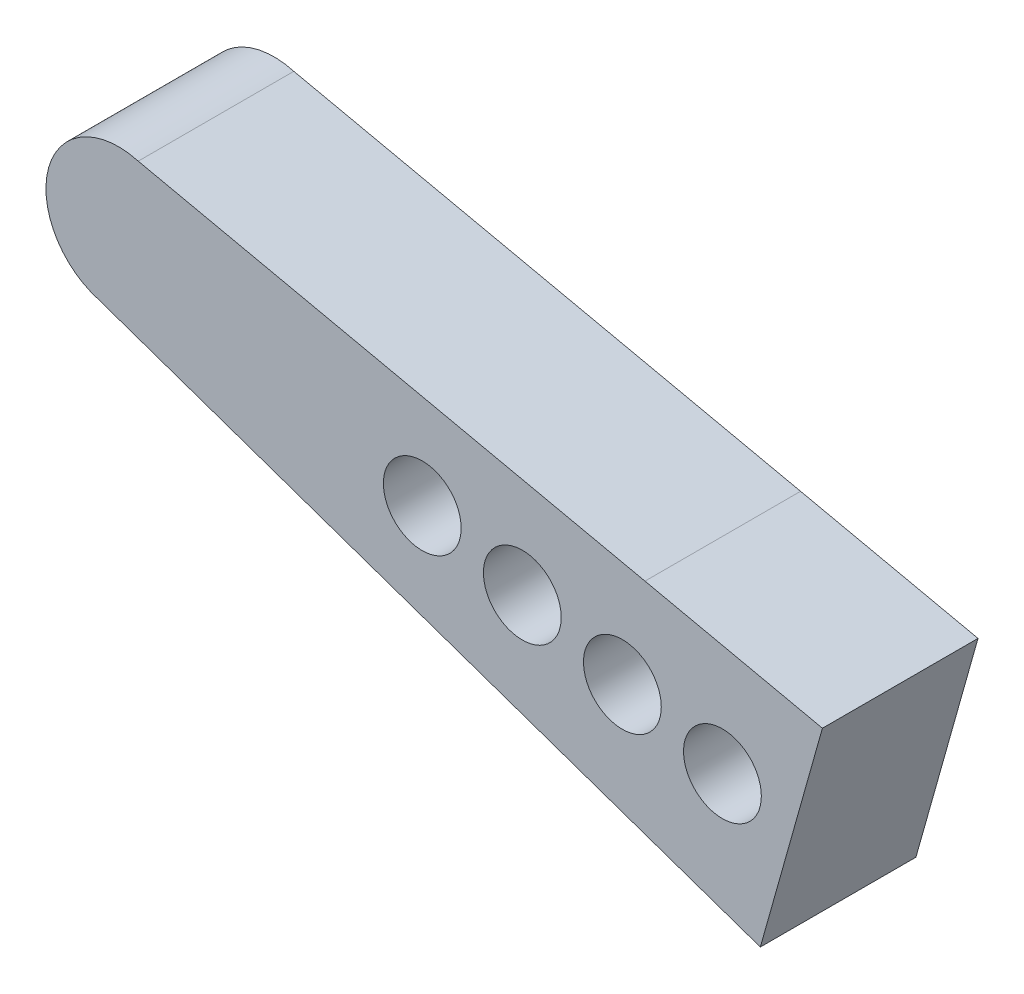
ISO-10303-21;
HEADER;
FILE_DESCRIPTION(('STEP AP214'),'2;1');
FILE_NAME('part.step','',(''),(''),'','','');
FILE_SCHEMA(('AUTOMOTIVE_DESIGN { 1 0 10303 214 1 1 1 1 }'));
ENDSEC;
DATA;
#1=APPLICATION_CONTEXT('core data for automotive mechanical design processes');
#2=APPLICATION_PROTOCOL_DEFINITION('international standard','automotive_design',2000,#1);
#3=PRODUCT_CONTEXT('',#1,'mechanical');
#4=PRODUCT('Part','Part','',(#3));
#5=PRODUCT_RELATED_PRODUCT_CATEGORY('part','',(#4));
#6=PRODUCT_DEFINITION_FORMATION('','',#4);
#7=PRODUCT_DEFINITION_CONTEXT('part definition',#1,'design');
#8=PRODUCT_DEFINITION('design','',#6,#7);
#9=PRODUCT_DEFINITION_SHAPE('','',#8);
#10=(LENGTH_UNIT() NAMED_UNIT(*) SI_UNIT(.MILLI.,.METRE.));
#11=(NAMED_UNIT(*) PLANE_ANGLE_UNIT() SI_UNIT($,.RADIAN.));
#12=(NAMED_UNIT(*) SI_UNIT($,.STERADIAN.) SOLID_ANGLE_UNIT());
#13=UNCERTAINTY_MEASURE_WITH_UNIT(LENGTH_MEASURE(1.E-05),#10,'distance_accuracy_value','');
#14=(GEOMETRIC_REPRESENTATION_CONTEXT(3) GLOBAL_UNCERTAINTY_ASSIGNED_CONTEXT((#13)) GLOBAL_UNIT_ASSIGNED_CONTEXT((#10,
#11,#12)) REPRESENTATION_CONTEXT('',''));
#15=CARTESIAN_POINT('',(0.,0.,0.));
#16=DIRECTION('',(0.,0.,1.));
#17=DIRECTION('',(1.,0.,0.));
#18=AXIS2_PLACEMENT_3D('',#15,#16,#17);
#19=CARTESIAN_POINT('',(-9.82567823233008,20.3732801024153,3.));
#20=DIRECTION('',(0.,0.,1.));
#21=DIRECTION('',(1.,0.,0.));
#22=AXIS2_PLACEMENT_3D('',#19,#20,#21);
#23=PLANE('',#22);
#24=CARTESIAN_POINT('',(-0.111080096823596,17.6504662561866,3.));
#25=DIRECTION('',(0.,0.,1.));
#26=DIRECTION('',(1.,0.,0.));
#27=AXIS2_PLACEMENT_3D('',#24,#25,#26);
#28=CIRCLE('',#27,0.75);
#29=CARTESIAN_POINT('',(0.638919903176405,17.6504662561866,3.));
#30=VERTEX_POINT('',#29);
#31=EDGE_CURVE('E192',#30,#30,#28,.T.);
#32=ORIENTED_EDGE('',*,*,#31,.F.);
#33=EDGE_LOOP('',(#32));
#34=FACE_BOUND('',#33,.T.);
#35=CARTESIAN_POINT('',(-3.96973296024154,18.7044103152507,3.));
#36=DIRECTION('',(0.,0.,1.));
#37=DIRECTION('',(1.,0.,0.));
#38=AXIS2_PLACEMENT_3D('',#35,#36,#37);
#39=CIRCLE('',#38,0.75);
#40=CARTESIAN_POINT('',(-3.21973296024154,18.7044103152507,3.));
#41=VERTEX_POINT('',#40);
#42=EDGE_CURVE('E125',#41,#41,#39,.T.);
#43=ORIENTED_EDGE('',*,*,#42,.F.);
#44=EDGE_LOOP('',(#43));
#45=FACE_BOUND('',#44,.T.);
#46=DIRECTION('',(0.944680088907505,-0.327993185328155,0.));
#47=VECTOR('',#46,1.);
#48=CARTESIAN_POINT('',(-0.759056855138387,15.7433635020479,3.));
#49=LINE('',#48,#47);
#50=CARTESIAN_POINT('',(-0.759056855138387,15.7433635020479,3.));
#51=VERTEX_POINT('',#50);
#52=CARTESIAN_POINT('',(2.54885464086585,14.5948557256081,3.));
#53=VERTEX_POINT('',#52);
#54=EDGE_CURVE('E132',#51,#53,#49,.T.);
#55=ORIENTED_EDGE('',*,*,#54,.T.);
#56=DIRECTION('',(0.270970748609426,0.962587582196055,0.));
#57=VECTOR('',#56,1.);
#58=CARTESIAN_POINT('',(3.74605928966986,18.8477661751682,3.));
#59=LINE('',#58,#57);
#60=CARTESIAN_POINT('',(3.74605928966986,18.8477661751682,3.));
#61=VERTEX_POINT('',#60);
#62=EDGE_CURVE('E90',#53,#61,#59,.T.);
#63=ORIENTED_EDGE('',*,*,#62,.T.);
#64=DIRECTION('',(-0.977056484887753,0.212980340263572,0.));
#65=VECTOR('',#64,1.);
#66=CARTESIAN_POINT('',(0.3247779304497,19.5935425752991,3.));
#67=LINE('',#66,#65);
#68=CARTESIAN_POINT('',(0.3247779304497,19.5935425752991,3.));
#69=VERTEX_POINT('',#68);
#70=EDGE_CURVE('E103',#61,#69,#67,.T.);
#71=ORIENTED_EDGE('',*,*,#70,.T.);
#72=DIRECTION('',(-0.977109711472658,0.212736014219075,0.));
#73=VECTOR('',#72,1.);
#74=CARTESIAN_POINT('',(0.3247779304497,19.5935425752991,3.));
#75=LINE('',#74,#73);
#76=CARTESIAN_POINT('',(-9.44631918427688,21.7209027174898,3.));
#77=VERTEX_POINT('',#76);
#78=EDGE_CURVE('E97',#69,#77,#75,.T.);
#79=ORIENTED_EDGE('',*,*,#78,.T.);
#80=CARTESIAN_POINT('',(-9.82567823233008,20.3732801024153,3.));
#81=DIRECTION('',(0.,0.,1.));
#82=DIRECTION('',(1.,0.,0.));
#83=AXIS2_PLACEMENT_3D('',#80,#81,#82);
#84=CIRCLE('',#83,1.4);
#85=CARTESIAN_POINT('',(-10.2050372803833,19.0256574873408,3.));
#86=VERTEX_POINT('',#85);
#87=EDGE_CURVE('E101',#77,#86,#84,.T.);
#88=ORIENTED_EDGE('',*,*,#87,.T.);
#89=DIRECTION('',(0.944598042524489,-0.328229398529296,0.));
#90=VECTOR('',#89,1.);
#91=CARTESIAN_POINT('',(-0.759056855138387,15.7433635020479,3.));
#92=LINE('',#91,#90);
#93=EDGE_CURVE('E53',#86,#51,#92,.T.);
#94=ORIENTED_EDGE('',*,*,#93,.T.);
#95=EDGE_LOOP('',(#55,#63,#71,#79,#88,#94));
#96=FACE_BOUND('',#95,.T.);
#97=CARTESIAN_POINT('',(-2.04040652853257,18.1774382857186,3.));
#98=DIRECTION('',(0.,0.,1.));
#99=DIRECTION('',(1.,0.,0.));
#100=AXIS2_PLACEMENT_3D('',#97,#98,#99);
#101=CIRCLE('',#100,0.75);
#102=CARTESIAN_POINT('',(-1.29040652853257,18.1774382857186,3.));
#103=VERTEX_POINT('',#102);
#104=EDGE_CURVE('E198',#103,#103,#101,.T.);
#105=ORIENTED_EDGE('',*,*,#104,.F.);
#106=EDGE_LOOP('',(#105));
#107=FACE_BOUND('',#106,.T.);
#108=CARTESIAN_POINT('',(1.81824633488538,17.1234942266545,3.));
#109=DIRECTION('',(0.,0.,1.));
#110=DIRECTION('',(1.,0.,0.));
#111=AXIS2_PLACEMENT_3D('',#108,#109,#110);
#112=CIRCLE('',#111,0.75);
#113=CARTESIAN_POINT('',(2.56824633488538,17.1234942266545,3.));
#114=VERTEX_POINT('',#113);
#115=EDGE_CURVE('E183',#114,#114,#112,.T.);
#116=ORIENTED_EDGE('',*,*,#115,.F.);
#117=EDGE_LOOP('',(#116));
#118=FACE_BOUND('',#117,.T.);
#119=ADVANCED_FACE('F36',(#34,#45,#96,#107,#118),#23,.T.);
#120=CARTESIAN_POINT('',(-9.82567823233008,20.3732801024153,0.));
#121=DIRECTION('',(0.,0.,1.));
#122=DIRECTION('',(1.,0.,0.));
#123=AXIS2_PLACEMENT_3D('',#120,#121,#122);
#124=PLANE('',#123);
#125=DIRECTION('',(0.944680088907505,-0.327993185328155,0.));
#126=VECTOR('',#125,1.);
#127=CARTESIAN_POINT('',(-0.759056855138387,15.7433635020479,0.));
#128=LINE('',#127,#126);
#129=CARTESIAN_POINT('',(-0.759056855138387,15.7433635020479,0.));
#130=VERTEX_POINT('',#129);
#131=CARTESIAN_POINT('',(2.54885464086585,14.5948557256081,0.));
#132=VERTEX_POINT('',#131);
#133=EDGE_CURVE('E121',#130,#132,#128,.T.);
#134=ORIENTED_EDGE('',*,*,#133,.F.);
#135=DIRECTION('',(0.944598042524489,-0.328229398529296,0.));
#136=VECTOR('',#135,1.);
#137=CARTESIAN_POINT('',(-0.759056855138387,15.7433635020479,0.));
#138=LINE('',#137,#136);
#139=CARTESIAN_POINT('',(-10.2050372803833,19.0256574873408,0.));
#140=VERTEX_POINT('',#139);
#141=EDGE_CURVE('E82',#140,#130,#138,.T.);
#142=ORIENTED_EDGE('',*,*,#141,.F.);
#143=CARTESIAN_POINT('',(-9.82567823233008,20.3732801024153,0.));
#144=DIRECTION('',(0.,0.,1.));
#145=DIRECTION('',(1.,0.,0.));
#146=AXIS2_PLACEMENT_3D('',#143,#144,#145);
#147=CIRCLE('',#146,1.4);
#148=CARTESIAN_POINT('',(-9.44631918427688,21.7209027174898,0.));
#149=VERTEX_POINT('',#148);
#150=EDGE_CURVE('E76',#149,#140,#147,.T.);
#151=ORIENTED_EDGE('',*,*,#150,.F.);
#152=DIRECTION('',(-0.977109711472658,0.212736014219075,0.));
#153=VECTOR('',#152,1.);
#154=CARTESIAN_POINT('',(0.3247779304497,19.5935425752991,0.));
#155=LINE('',#154,#153);
#156=CARTESIAN_POINT('',(0.3247779304497,19.5935425752991,0.));
#157=VERTEX_POINT('',#156);
#158=EDGE_CURVE('E111',#157,#149,#155,.T.);
#159=ORIENTED_EDGE('',*,*,#158,.F.);
#160=DIRECTION('',(-0.977056484887753,0.212980340263572,0.));
#161=VECTOR('',#160,1.);
#162=CARTESIAN_POINT('',(0.3247779304497,19.5935425752991,0.));
#163=LINE('',#162,#161);
#164=CARTESIAN_POINT('',(3.74605928966986,18.8477661751682,0.));
#165=VERTEX_POINT('',#164);
#166=EDGE_CURVE('E127',#165,#157,#163,.T.);
#167=ORIENTED_EDGE('',*,*,#166,.F.);
#168=DIRECTION('',(0.270970748609426,0.962587582196055,0.));
#169=VECTOR('',#168,1.);
#170=CARTESIAN_POINT('',(3.74605928966986,18.8477661751682,0.));
#171=LINE('',#170,#169);
#172=EDGE_CURVE('E124',#132,#165,#171,.T.);
#173=ORIENTED_EDGE('',*,*,#172,.F.);
#174=EDGE_LOOP('',(#134,#142,#151,#159,#167,#173));
#175=FACE_BOUND('',#174,.T.);
#176=CARTESIAN_POINT('',(-3.96973296024154,18.7044103152507,0.));
#177=DIRECTION('',(0.,0.,1.));
#178=DIRECTION('',(1.,0.,0.));
#179=AXIS2_PLACEMENT_3D('',#176,#177,#178);
#180=CIRCLE('',#179,0.75);
#181=CARTESIAN_POINT('',(-3.21973296024154,18.7044103152507,0.));
#182=VERTEX_POINT('',#181);
#183=EDGE_CURVE('E201',#182,#182,#180,.T.);
#184=ORIENTED_EDGE('',*,*,#183,.T.);
#185=EDGE_LOOP('',(#184));
#186=FACE_BOUND('',#185,.T.);
#187=CARTESIAN_POINT('',(-2.04040652853257,18.1774382857186,0.));
#188=DIRECTION('',(0.,0.,1.));
#189=DIRECTION('',(1.,0.,0.));
#190=AXIS2_PLACEMENT_3D('',#187,#188,#189);
#191=CIRCLE('',#190,0.75);
#192=CARTESIAN_POINT('',(-1.29040652853257,18.1774382857186,0.));
#193=VERTEX_POINT('',#192);
#194=EDGE_CURVE('E195',#193,#193,#191,.T.);
#195=ORIENTED_EDGE('',*,*,#194,.T.);
#196=EDGE_LOOP('',(#195));
#197=FACE_BOUND('',#196,.T.);
#198=CARTESIAN_POINT('',(-0.111080096823596,17.6504662561866,0.));
#199=DIRECTION('',(0.,0.,1.));
#200=DIRECTION('',(1.,0.,0.));
#201=AXIS2_PLACEMENT_3D('',#198,#199,#200);
#202=CIRCLE('',#201,0.75);
#203=CARTESIAN_POINT('',(0.638919903176405,17.6504662561866,0.));
#204=VERTEX_POINT('',#203);
#205=EDGE_CURVE('E189',#204,#204,#202,.T.);
#206=ORIENTED_EDGE('',*,*,#205,.T.);
#207=EDGE_LOOP('',(#206));
#208=FACE_BOUND('',#207,.T.);
#209=CARTESIAN_POINT('',(1.81824633488538,17.1234942266545,0.));
#210=DIRECTION('',(0.,0.,1.));
#211=DIRECTION('',(1.,0.,0.));
#212=AXIS2_PLACEMENT_3D('',#209,#210,#211);
#213=CIRCLE('',#212,0.75);
#214=CARTESIAN_POINT('',(2.56824633488538,17.1234942266545,0.));
#215=VERTEX_POINT('',#214);
#216=EDGE_CURVE('E186',#215,#215,#213,.T.);
#217=ORIENTED_EDGE('',*,*,#216,.T.);
#218=EDGE_LOOP('',(#217));
#219=FACE_BOUND('',#218,.T.);
#220=ADVANCED_FACE('F141',(#175,#186,#197,#208,#219),#124,.F.);
#221=CARTESIAN_POINT('',(-0.759056855138387,15.7433635020479,3.));
#222=DIRECTION('',(0.327993185328155,0.944680088907504,0.));
#223=DIRECTION('',(-0.944680088907505,0.327993185328155,0.));
#224=AXIS2_PLACEMENT_3D('',#221,#222,#223);
#225=PLANE('',#224);
#226=ORIENTED_EDGE('',*,*,#133,.T.);
#227=DIRECTION('',(0.,0.,-1.));
#228=VECTOR('',#227,1.);
#229=CARTESIAN_POINT('',(2.54885464086585,14.5948557256081,3.));
#230=LINE('',#229,#228);
#231=EDGE_CURVE('E11',#53,#132,#230,.T.);
#232=ORIENTED_EDGE('',*,*,#231,.F.);
#233=ORIENTED_EDGE('',*,*,#54,.F.);
#234=DIRECTION('',(0.,0.,-1.));
#235=VECTOR('',#234,1.);
#236=CARTESIAN_POINT('',(-0.759056855138387,15.7433635020479,3.));
#237=LINE('',#236,#235);
#238=EDGE_CURVE('E117',#51,#130,#237,.T.);
#239=ORIENTED_EDGE('',*,*,#238,.T.);
#240=EDGE_LOOP('',(#226,#232,#233,#239));
#241=FACE_BOUND('',#240,.T.);
#242=ADVANCED_FACE('F38',(#241),#225,.F.);
#243=CARTESIAN_POINT('',(3.74605928966986,18.8477661751682,3.));
#244=DIRECTION('',(-0.962587582196055,0.270970748609426,0.));
#245=DIRECTION('',(-0.270970748609426,-0.962587582196055,0.));
#246=AXIS2_PLACEMENT_3D('',#243,#244,#245);
#247=PLANE('',#246);
#248=ORIENTED_EDGE('',*,*,#172,.T.);
#249=DIRECTION('',(0.,0.,-1.));
#250=VECTOR('',#249,1.);
#251=CARTESIAN_POINT('',(3.74605928966986,18.8477661751682,3.));
#252=LINE('',#251,#250);
#253=EDGE_CURVE('E45',#61,#165,#252,.T.);
#254=ORIENTED_EDGE('',*,*,#253,.F.);
#255=ORIENTED_EDGE('',*,*,#62,.F.);
#256=ORIENTED_EDGE('',*,*,#231,.T.);
#257=EDGE_LOOP('',(#248,#254,#255,#256));
#258=FACE_BOUND('',#257,.T.);
#259=ADVANCED_FACE('F259',(#258),#247,.F.);
#260=CARTESIAN_POINT('',(0.3247779304497,19.5935425752991,3.));
#261=DIRECTION('',(-0.212980340263572,-0.977056484887754,0.));
#262=DIRECTION('',(0.977056484887754,-0.212980340263572,0.));
#263=AXIS2_PLACEMENT_3D('',#260,#261,#262);
#264=PLANE('',#263);
#265=ORIENTED_EDGE('',*,*,#166,.T.);
#266=DIRECTION('',(0.,0.,-1.));
#267=VECTOR('',#266,1.);
#268=CARTESIAN_POINT('',(0.3247779304497,19.5935425752991,3.));
#269=LINE('',#268,#267);
#270=EDGE_CURVE('E112',#69,#157,#269,.T.);
#271=ORIENTED_EDGE('',*,*,#270,.F.);
#272=ORIENTED_EDGE('',*,*,#70,.F.);
#273=ORIENTED_EDGE('',*,*,#253,.T.);
#274=EDGE_LOOP('',(#265,#271,#272,#273));
#275=FACE_BOUND('',#274,.T.);
#276=ADVANCED_FACE('F138',(#275),#264,.F.);
#277=CARTESIAN_POINT('',(0.3247779304497,19.5935425752991,3.));
#278=DIRECTION('',(-0.212736014219075,-0.977109711472658,0.));
#279=DIRECTION('',(0.977109711472658,-0.212736014219075,0.));
#280=AXIS2_PLACEMENT_3D('',#277,#278,#279);
#281=PLANE('',#280);
#282=ORIENTED_EDGE('',*,*,#158,.T.);
#283=DIRECTION('',(0.,0.,-1.));
#284=VECTOR('',#283,1.);
#285=CARTESIAN_POINT('',(-9.44631918427688,21.7209027174898,3.));
#286=LINE('',#285,#284);
#287=EDGE_CURVE('E108',#77,#149,#286,.T.);
#288=ORIENTED_EDGE('',*,*,#287,.F.);
#289=ORIENTED_EDGE('',*,*,#78,.F.);
#290=ORIENTED_EDGE('',*,*,#270,.T.);
#291=EDGE_LOOP('',(#282,#288,#289,#290));
#292=FACE_BOUND('',#291,.T.);
#293=ADVANCED_FACE('F109',(#292),#281,.F.);
#294=CARTESIAN_POINT('',(-9.82567823233008,20.3732801024153,3.));
#295=DIRECTION('',(0.,0.,-1.));
#296=DIRECTION('',(-1.,0.,0.));
#297=AXIS2_PLACEMENT_3D('',#294,#295,#296);
#298=CYLINDRICAL_SURFACE('',#297,1.4);
#299=ORIENTED_EDGE('',*,*,#150,.T.);
#300=DIRECTION('',(0.,0.,-1.));
#301=VECTOR('',#300,1.);
#302=CARTESIAN_POINT('',(-10.2050372803833,19.0256574873408,3.));
#303=LINE('',#302,#301);
#304=EDGE_CURVE('E113',#86,#140,#303,.T.);
#305=ORIENTED_EDGE('',*,*,#304,.F.);
#306=ORIENTED_EDGE('',*,*,#87,.F.);
#307=ORIENTED_EDGE('',*,*,#287,.T.);
#308=EDGE_LOOP('',(#299,#305,#306,#307));
#309=FACE_BOUND('',#308,.T.);
#310=ADVANCED_FACE('F115',(#309),#298,.T.);
#311=CARTESIAN_POINT('',(-0.759056855138387,15.7433635020479,3.));
#312=DIRECTION('',(0.328229398529296,0.944598042524489,0.));
#313=DIRECTION('',(-0.944598042524489,0.328229398529296,0.));
#314=AXIS2_PLACEMENT_3D('',#311,#312,#313);
#315=PLANE('',#314);
#316=ORIENTED_EDGE('',*,*,#141,.T.);
#317=ORIENTED_EDGE('',*,*,#238,.F.);
#318=ORIENTED_EDGE('',*,*,#93,.F.);
#319=ORIENTED_EDGE('',*,*,#304,.T.);
#320=EDGE_LOOP('',(#316,#317,#318,#319));
#321=FACE_BOUND('',#320,.T.);
#322=ADVANCED_FACE('F146',(#321),#315,.F.);
#323=CARTESIAN_POINT('',(-3.96973296024154,18.7044103152507,3.));
#324=DIRECTION('',(0.,0.,-1.));
#325=DIRECTION('',(-1.,0.,0.));
#326=AXIS2_PLACEMENT_3D('',#323,#324,#325);
#327=CYLINDRICAL_SURFACE('',#326,0.75);
#328=ORIENTED_EDGE('',*,*,#42,.T.);
#329=EDGE_LOOP('',(#328));
#330=FACE_BOUND('',#329,.T.);
#331=ORIENTED_EDGE('',*,*,#183,.F.);
#332=EDGE_LOOP('',(#331));
#333=FACE_BOUND('',#332,.T.);
#334=ADVANCED_FACE('F148',(#330,#333),#327,.F.);
#335=CARTESIAN_POINT('',(-2.04040652853257,18.1774382857186,3.));
#336=DIRECTION('',(0.,0.,-1.));
#337=DIRECTION('',(-1.,0.,0.));
#338=AXIS2_PLACEMENT_3D('',#335,#336,#337);
#339=CYLINDRICAL_SURFACE('',#338,0.75);
#340=ORIENTED_EDGE('',*,*,#104,.T.);
#341=EDGE_LOOP('',(#340));
#342=FACE_BOUND('',#341,.T.);
#343=ORIENTED_EDGE('',*,*,#194,.F.);
#344=EDGE_LOOP('',(#343));
#345=FACE_BOUND('',#344,.T.);
#346=ADVANCED_FACE('F154',(#342,#345),#339,.F.);
#347=CARTESIAN_POINT('',(-0.111080096823596,17.6504662561866,3.));
#348=DIRECTION('',(0.,0.,-1.));
#349=DIRECTION('',(-1.,0.,0.));
#350=AXIS2_PLACEMENT_3D('',#347,#348,#349);
#351=CYLINDRICAL_SURFACE('',#350,0.75);
#352=ORIENTED_EDGE('',*,*,#31,.T.);
#353=EDGE_LOOP('',(#352));
#354=FACE_BOUND('',#353,.T.);
#355=ORIENTED_EDGE('',*,*,#205,.F.);
#356=EDGE_LOOP('',(#355));
#357=FACE_BOUND('',#356,.T.);
#358=ADVANCED_FACE('F170',(#354,#357),#351,.F.);
#359=CARTESIAN_POINT('',(1.81824633488538,17.1234942266545,3.));
#360=DIRECTION('',(0.,0.,-1.));
#361=DIRECTION('',(-1.,0.,0.));
#362=AXIS2_PLACEMENT_3D('',#359,#360,#361);
#363=CYLINDRICAL_SURFACE('',#362,0.75);
#364=ORIENTED_EDGE('',*,*,#115,.T.);
#365=EDGE_LOOP('',(#364));
#366=FACE_BOUND('',#365,.T.);
#367=ORIENTED_EDGE('',*,*,#216,.F.);
#368=EDGE_LOOP('',(#367));
#369=FACE_BOUND('',#368,.T.);
#370=ADVANCED_FACE('F174',(#366,#369),#363,.F.);
#371=CLOSED_SHELL('',(#119,#220,#242,#259,#276,#293,#310,#322,#334,#346,#358,#370));
#372=MANIFOLD_SOLID_BREP('B2',#371);
#373=ADVANCED_BREP_SHAPE_REPRESENTATION('',(#18,#372),#14);
#374=SHAPE_DEFINITION_REPRESENTATION(#9,#373);
ENDSEC;
END-ISO-10303-21;
